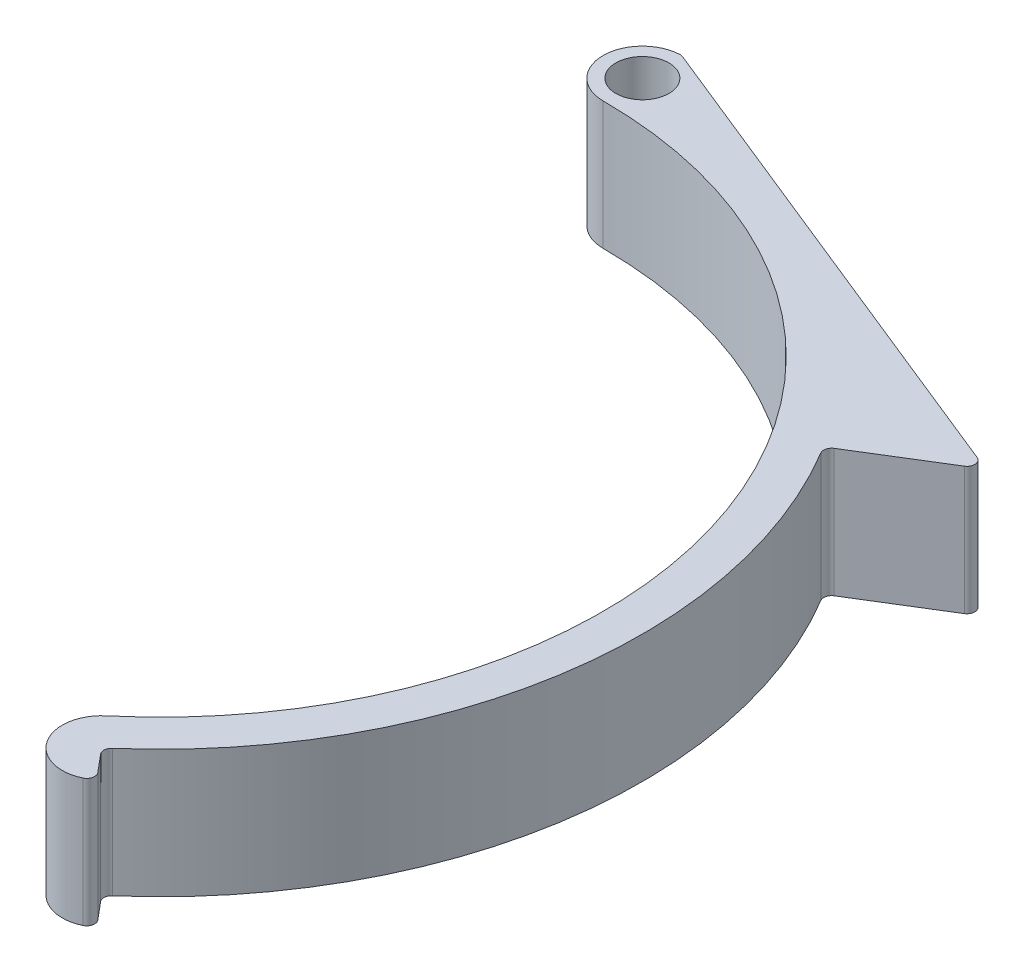
ISO-10303-21;
HEADER;
FILE_DESCRIPTION(('STEP AP214'),'2;1');
FILE_NAME('part.step','',(''),(''),'','','');
FILE_SCHEMA(('AUTOMOTIVE_DESIGN { 1 0 10303 214 1 1 1 1 }'));
ENDSEC;
DATA;
#1=APPLICATION_CONTEXT('core data for automotive mechanical design processes');
#2=APPLICATION_PROTOCOL_DEFINITION('international standard','automotive_design',2000,#1);
#3=PRODUCT_CONTEXT('',#1,'mechanical');
#4=PRODUCT('Part','Part','',(#3));
#5=PRODUCT_RELATED_PRODUCT_CATEGORY('part','',(#4));
#6=PRODUCT_DEFINITION_FORMATION('','',#4);
#7=PRODUCT_DEFINITION_CONTEXT('part definition',#1,'design');
#8=PRODUCT_DEFINITION('design','',#6,#7);
#9=PRODUCT_DEFINITION_SHAPE('','',#8);
#10=(LENGTH_UNIT() NAMED_UNIT(*) SI_UNIT(.MILLI.,.METRE.));
#11=(NAMED_UNIT(*) PLANE_ANGLE_UNIT() SI_UNIT($,.RADIAN.));
#12=(NAMED_UNIT(*) SI_UNIT($,.STERADIAN.) SOLID_ANGLE_UNIT());
#13=UNCERTAINTY_MEASURE_WITH_UNIT(LENGTH_MEASURE(1.E-05),#10,'distance_accuracy_value','');
#14=(GEOMETRIC_REPRESENTATION_CONTEXT(3) GLOBAL_UNCERTAINTY_ASSIGNED_CONTEXT((#13)) GLOBAL_UNIT_ASSIGNED_CONTEXT((#10,
#11,#12)) REPRESENTATION_CONTEXT('',''));
#15=CARTESIAN_POINT('',(0.,0.,0.));
#16=DIRECTION('',(0.,0.,1.));
#17=DIRECTION('',(1.,0.,0.));
#18=AXIS2_PLACEMENT_3D('',#15,#16,#17);
#19=CARTESIAN_POINT('',(18.4107690922549,13.,-45.5602618405853));
#20=DIRECTION('',(0.374663072776281,0.,-0.927161033422908));
#21=DIRECTION('',(-0.927161033422908,0.,-0.374663072776281));
#22=AXIS2_PLACEMENT_3D('',#19,#20,#21);
#23=PLANE('',#22);
#24=DIRECTION('',(0.927161033422908,0.,0.374663072776281));
#25=VECTOR('',#24,1.);
#26=CARTESIAN_POINT('',(18.4107690922549,0.,-45.5602618405853));
#27=LINE('',#26,#25);
#28=CARTESIAN_POINT('',(0.152578115339287,0.,-52.938343628053));
#29=VERTEX_POINT('',#28);
#30=CARTESIAN_POINT('',(50.4547105940548,0.,-32.6113984240491));
#31=VERTEX_POINT('',#30);
#32=EDGE_CURVE('E189',#29,#31,#27,.T.);
#33=ORIENTED_EDGE('',*,*,#32,.F.);
#34=DIRECTION('',(0.,-1.,0.));
#35=VECTOR('',#34,1.);
#36=CARTESIAN_POINT('',(0.152578115339284,13.,-52.938343628053));
#37=LINE('',#36,#35);
#38=CARTESIAN_POINT('',(0.152578115339287,13.,-52.938343628053));
#39=VERTEX_POINT('',#38);
#40=EDGE_CURVE('E231',#29,#39,#37,.F.);
#41=ORIENTED_EDGE('',*,*,#40,.T.);
#42=DIRECTION('',(0.927161033422908,0.,0.374663072776281));
#43=VECTOR('',#42,1.);
#44=CARTESIAN_POINT('',(18.4107690922549,13.,-45.5602618405853));
#45=LINE('',#44,#43);
#46=CARTESIAN_POINT('',(50.4547105940548,13.,-32.6113984240491));
#47=VERTEX_POINT('',#46);
#48=EDGE_CURVE('E165',#39,#47,#45,.T.);
#49=ORIENTED_EDGE('',*,*,#48,.T.);
#50=DIRECTION('',(0.,-1.,0.));
#51=VECTOR('',#50,1.);
#52=CARTESIAN_POINT('',(50.4547105940548,13.,-32.6113984240491));
#53=LINE('',#52,#51);
#54=EDGE_CURVE('E227',#47,#31,#53,.T.);
#55=ORIENTED_EDGE('',*,*,#54,.T.);
#56=EDGE_LOOP('',(#33,#41,#49,#55));
#57=FACE_BOUND('',#56,.T.);
#58=ADVANCED_FACE('F45',(#57),#23,.T.);
#59=CARTESIAN_POINT('',(0.,13.,-49.));
#60=DIRECTION('',(0.,-1.,0.));
#61=DIRECTION('',(0.,0.,-1.));
#62=AXIS2_PLACEMENT_3D('',#59,#60,#61);
#63=CYLINDRICAL_SURFACE('',#62,4.);
#64=CARTESIAN_POINT('',(0.,13.,-49.));
#65=DIRECTION('',(0.,1.,0.));
#66=DIRECTION('',(0.,0.,1.));
#67=AXIS2_PLACEMENT_3D('',#64,#65,#66);
#68=CIRCLE('',#67,4.);
#69=CARTESIAN_POINT('',(0.,13.,-45.));
#70=VERTEX_POINT('',#69);
#71=CARTESIAN_POINT('',(-0.183940428602176,13.,-52.9957685016434));
#72=VERTEX_POINT('',#71);
#73=EDGE_CURVE('E140',#70,#72,#68,.F.);
#74=ORIENTED_EDGE('',*,*,#73,.T.);
#75=DIRECTION('',(0.,-1.,0.));
#76=VECTOR('',#75,1.);
#77=CARTESIAN_POINT('',(-0.183940428602176,13.,-52.9957685016434));
#78=LINE('',#77,#76);
#79=CARTESIAN_POINT('',(-0.183940428602176,0.,-52.9957685016434));
#80=VERTEX_POINT('',#79);
#81=EDGE_CURVE('E148',#72,#80,#78,.T.);
#82=ORIENTED_EDGE('',*,*,#81,.T.);
#83=CARTESIAN_POINT('',(0.,0.,-49.));
#84=DIRECTION('',(0.,1.,0.));
#85=DIRECTION('',(0.,0.,1.));
#86=AXIS2_PLACEMENT_3D('',#83,#84,#85);
#87=CIRCLE('',#86,4.);
#88=CARTESIAN_POINT('',(0.,0.,-45.));
#89=VERTEX_POINT('',#88);
#90=EDGE_CURVE('E143',#89,#80,#87,.F.);
#91=ORIENTED_EDGE('',*,*,#90,.F.);
#92=DIRECTION('',(0.,-1.,0.));
#93=VECTOR('',#92,1.);
#94=CARTESIAN_POINT('',(0.,13.,-45.));
#95=LINE('',#94,#93);
#96=EDGE_CURVE('E135',#70,#89,#95,.T.);
#97=ORIENTED_EDGE('',*,*,#96,.F.);
#98=EDGE_LOOP('',(#74,#82,#91,#97));
#99=FACE_BOUND('',#98,.T.);
#100=ADVANCED_FACE('F137',(#99),#63,.T.);
#101=CARTESIAN_POINT('',(0.,13.,0.));
#102=DIRECTION('',(0.,-1.,0.));
#103=DIRECTION('',(0.,0.,-1.));
#104=AXIS2_PLACEMENT_3D('',#101,#102,#103);
#105=CYLINDRICAL_SURFACE('',#104,45.);
#106=CARTESIAN_POINT('',(0.,0.,0.));
#107=DIRECTION('',(0.,1.,0.));
#108=DIRECTION('',(0.,0.,1.));
#109=AXIS2_PLACEMENT_3D('',#106,#107,#108);
#110=CIRCLE('',#109,45.);
#111=CARTESIAN_POINT('',(28.9254424358944,0.,34.4719999403539));
#112=VERTEX_POINT('',#111);
#113=EDGE_CURVE('E195',#89,#112,#110,.F.);
#114=ORIENTED_EDGE('',*,*,#113,.T.);
#115=DIRECTION('',(0.,-1.,0.));
#116=VECTOR('',#115,1.);
#117=CARTESIAN_POINT('',(28.9254424358944,13.,34.4719999403539));
#118=LINE('',#117,#116);
#119=CARTESIAN_POINT('',(28.9254424358944,13.,34.4719999403539));
#120=VERTEX_POINT('',#119);
#121=EDGE_CURVE('E149',#120,#112,#118,.T.);
#122=ORIENTED_EDGE('',*,*,#121,.F.);
#123=CARTESIAN_POINT('',(0.,13.,0.));
#124=DIRECTION('',(0.,1.,0.));
#125=DIRECTION('',(0.,0.,1.));
#126=AXIS2_PLACEMENT_3D('',#123,#124,#125);
#127=CIRCLE('',#126,45.);
#128=EDGE_CURVE('E153',#70,#120,#127,.F.);
#129=ORIENTED_EDGE('',*,*,#128,.F.);
#130=ORIENTED_EDGE('',*,*,#96,.T.);
#131=EDGE_LOOP('',(#114,#122,#129,#130));
#132=FACE_BOUND('',#131,.T.);
#133=ADVANCED_FACE('F154',(#132),#105,.F.);
#134=CARTESIAN_POINT('',(31.4965928746405,13.,37.5361777128298));
#135=DIRECTION('',(0.,-1.,0.));
#136=DIRECTION('',(0.,0.,-1.));
#137=AXIS2_PLACEMENT_3D('',#134,#135,#136);
#138=CYLINDRICAL_SURFACE('',#137,4.);
#139=CARTESIAN_POINT('',(31.4965928746405,0.,37.5361777128298));
#140=DIRECTION('',(0.,1.,0.));
#141=DIRECTION('',(0.,0.,1.));
#142=AXIS2_PLACEMENT_3D('',#139,#140,#141);
#143=CIRCLE('',#142,4.);
#144=CARTESIAN_POINT('',(33.220054138986,0.,41.1458426931709));
#145=VERTEX_POINT('',#144);
#146=EDGE_CURVE('E198',#112,#145,#143,.T.);
#147=ORIENTED_EDGE('',*,*,#146,.T.);
#148=DIRECTION('',(0.,-1.,0.));
#149=VECTOR('',#148,1.);
#150=CARTESIAN_POINT('',(33.220054138986,13.,41.1458426931709));
#151=LINE('',#150,#149);
#152=CARTESIAN_POINT('',(33.220054138986,13.,41.1458426931709));
#153=VERTEX_POINT('',#152);
#154=EDGE_CURVE('E256',#145,#153,#151,.F.);
#155=ORIENTED_EDGE('',*,*,#154,.T.);
#156=CARTESIAN_POINT('',(31.4965928746405,13.,37.5361777128298));
#157=DIRECTION('',(0.,1.,0.));
#158=DIRECTION('',(0.,0.,1.));
#159=AXIS2_PLACEMENT_3D('',#156,#157,#158);
#160=CIRCLE('',#159,4.);
#161=EDGE_CURVE('E158',#120,#153,#160,.T.);
#162=ORIENTED_EDGE('',*,*,#161,.F.);
#163=ORIENTED_EDGE('',*,*,#121,.T.);
#164=EDGE_LOOP('',(#147,#155,#162,#163));
#165=FACE_BOUND('',#164,.T.);
#166=ADVANCED_FACE('F334',(#165),#138,.T.);
#167=CARTESIAN_POINT('',(0.,13.,0.));
#168=DIRECTION('',(0.766044443118976,0.,-0.642787609686541));
#169=DIRECTION('',(-0.642787609686542,0.,-0.766044443118976));
#170=AXIS2_PLACEMENT_3D('',#167,#168,#169);
#171=PLANE('',#170);
#172=DIRECTION('',(0.642787609686542,0.,0.766044443118976));
#173=VECTOR('',#172,1.);
#174=CARTESIAN_POINT('',(0.,0.,0.));
#175=LINE('',#174,#173);
#176=CARTESIAN_POINT('',(32.0066923337341,0.,38.1440905757849));
#177=VERTEX_POINT('',#176);
#178=CARTESIAN_POINT('',(33.4881974406121,0.,39.9096796093534));
#179=VERTEX_POINT('',#178);
#180=EDGE_CURVE('E202',#177,#179,#175,.T.);
#181=ORIENTED_EDGE('',*,*,#180,.F.);
#182=DIRECTION('',(0.,-1.,0.));
#183=VECTOR('',#182,1.);
#184=CARTESIAN_POINT('',(32.0066923337341,13.,38.1440905757849));
#185=LINE('',#184,#183);
#186=CARTESIAN_POINT('',(32.0066923337341,13.,38.1440905757849));
#187=VERTEX_POINT('',#186);
#188=EDGE_CURVE('E253',#177,#187,#185,.F.);
#189=ORIENTED_EDGE('',*,*,#188,.T.);
#190=DIRECTION('',(0.642787609686542,0.,0.766044443118976));
#191=VECTOR('',#190,1.);
#192=CARTESIAN_POINT('',(0.,13.,0.));
#193=LINE('',#192,#191);
#194=CARTESIAN_POINT('',(33.4881974406121,13.,39.9096796093534));
#195=VERTEX_POINT('',#194);
#196=EDGE_CURVE('E175',#187,#195,#193,.T.);
#197=ORIENTED_EDGE('',*,*,#196,.T.);
#198=DIRECTION('',(0.,1.,0.));
#199=VECTOR('',#198,1.);
#200=CARTESIAN_POINT('',(33.4881974406121,0.,39.9096796093534));
#201=LINE('',#200,#199);
#202=EDGE_CURVE('E249',#195,#179,#201,.F.);
#203=ORIENTED_EDGE('',*,*,#202,.T.);
#204=EDGE_LOOP('',(#181,#189,#197,#203));
#205=FACE_BOUND('',#204,.T.);
#206=ADVANCED_FACE('F319',(#205),#171,.T.);
#207=CARTESIAN_POINT('',(0.,13.,0.));
#208=DIRECTION('',(0.,-1.,0.));
#209=DIRECTION('',(0.,0.,-1.));
#210=AXIS2_PLACEMENT_3D('',#207,#208,#209);
#211=CYLINDRICAL_SURFACE('',#210,49.);
#212=CARTESIAN_POINT('',(0.,13.,0.));
#213=DIRECTION('',(0.,1.,0.));
#214=DIRECTION('',(0.,0.,1.));
#215=AXIS2_PLACEMENT_3D('',#212,#213,#214);
#216=CIRCLE('',#215,49.);
#217=CARTESIAN_POINT('',(32.0955194080971,13.,37.0253647372239));
#218=VERTEX_POINT('',#217);
#219=CARTESIAN_POINT('',(42.1148392112088,13.,-25.0467626294103));
#220=VERTEX_POINT('',#219);
#221=EDGE_CURVE('E179',#218,#220,#216,.T.);
#222=ORIENTED_EDGE('',*,*,#221,.F.);
#223=DIRECTION('',(0.,-1.,0.));
#224=VECTOR('',#223,1.);
#225=CARTESIAN_POINT('',(32.0955194080971,13.,37.0253647372239));
#226=LINE('',#225,#224);
#227=CARTESIAN_POINT('',(32.0955194080971,0.,37.0253647372239));
#228=VERTEX_POINT('',#227);
#229=EDGE_CURVE('E245',#218,#228,#226,.T.);
#230=ORIENTED_EDGE('',*,*,#229,.T.);
#231=CARTESIAN_POINT('',(0.,0.,0.));
#232=DIRECTION('',(0.,1.,0.));
#233=DIRECTION('',(0.,0.,1.));
#234=AXIS2_PLACEMENT_3D('',#231,#232,#233);
#235=CIRCLE('',#234,49.);
#236=CARTESIAN_POINT('',(42.1148392112088,0.,-25.0467626294103));
#237=VERTEX_POINT('',#236);
#238=EDGE_CURVE('E206',#228,#237,#235,.T.);
#239=ORIENTED_EDGE('',*,*,#238,.T.);
#240=DIRECTION('',(0.,-1.,0.));
#241=VECTOR('',#240,1.);
#242=CARTESIAN_POINT('',(42.1148392112088,13.,-25.0467626294103));
#243=LINE('',#242,#241);
#244=EDGE_CURVE('E242',#237,#220,#243,.F.);
#245=ORIENTED_EDGE('',*,*,#244,.T.);
#246=EDGE_LOOP('',(#222,#230,#239,#245));
#247=FACE_BOUND('',#246,.T.);
#248=ADVANCED_FACE('F279',(#247),#211,.T.);
#249=CARTESIAN_POINT('',(0.,13.,-49.));
#250=DIRECTION('',(0.,-1.,0.));
#251=DIRECTION('',(0.,0.,-1.));
#252=AXIS2_PLACEMENT_3D('',#249,#250,#251);
#253=CYLINDRICAL_SURFACE('',#252,2.7);
#254=CARTESIAN_POINT('',(0.,13.,-49.));
#255=DIRECTION('',(0.,1.,0.));
#256=DIRECTION('',(0.,0.,1.));
#257=AXIS2_PLACEMENT_3D('',#254,#255,#256);
#258=CIRCLE('',#257,2.7);
#259=CARTESIAN_POINT('',(0.,13.,-46.3));
#260=VERTEX_POINT('',#259);
#261=EDGE_CURVE('E169',#260,#260,#258,.T.);
#262=ORIENTED_EDGE('',*,*,#261,.T.);
#263=EDGE_LOOP('',(#262));
#264=FACE_BOUND('',#263,.T.);
#265=CARTESIAN_POINT('',(0.,0.,-49.));
#266=DIRECTION('',(0.,1.,0.));
#267=DIRECTION('',(0.,0.,1.));
#268=AXIS2_PLACEMENT_3D('',#265,#266,#267);
#269=CIRCLE('',#268,2.7);
#270=CARTESIAN_POINT('',(0.,0.,-46.3));
#271=VERTEX_POINT('',#270);
#272=EDGE_CURVE('E185',#271,#271,#269,.T.);
#273=ORIENTED_EDGE('',*,*,#272,.F.);
#274=EDGE_LOOP('',(#273));
#275=FACE_BOUND('',#274,.T.);
#276=ADVANCED_FACE('F311',(#264,#275),#253,.F.);
#277=CARTESIAN_POINT('',(0.,13.,0.));
#278=DIRECTION('',(0.524899474172595,0.,0.851164227404637));
#279=DIRECTION('',(0.851164227404637,0.,-0.524899474172595));
#280=AXIS2_PLACEMENT_3D('',#277,#278,#279);
#281=PLANE('',#280);
#282=DIRECTION('',(-0.851164227404637,0.,0.524899474172595));
#283=VECTOR('',#282,1.);
#284=CARTESIAN_POINT('',(0.,0.,0.));
#285=LINE('',#284,#283);
#286=CARTESIAN_POINT('',(50.5748997151719,0.,-31.1887382153871));
#287=VERTEX_POINT('',#286);
#288=CARTESIAN_POINT('',(42.3825088434823,0.,-26.1366207481407));
#289=VERTEX_POINT('',#288);
#290=EDGE_CURVE('E210',#287,#289,#285,.T.);
#291=ORIENTED_EDGE('',*,*,#290,.F.);
#292=DIRECTION('',(0.,-1.,0.));
#293=VECTOR('',#292,1.);
#294=CARTESIAN_POINT('',(50.5748997151719,13.,-31.1887382153871));
#295=LINE('',#294,#293);
#296=CARTESIAN_POINT('',(50.5748997151719,13.,-31.1887382153871));
#297=VERTEX_POINT('',#296);
#298=EDGE_CURVE('E66',#287,#297,#295,.F.);
#299=ORIENTED_EDGE('',*,*,#298,.T.);
#300=DIRECTION('',(-0.851164227404637,0.,0.524899474172595));
#301=VECTOR('',#300,1.);
#302=CARTESIAN_POINT('',(0.,13.,0.));
#303=LINE('',#302,#301);
#304=CARTESIAN_POINT('',(42.3825088434823,13.,-26.1366207481407));
#305=VERTEX_POINT('',#304);
#306=EDGE_CURVE('E182',#297,#305,#303,.T.);
#307=ORIENTED_EDGE('',*,*,#306,.T.);
#308=DIRECTION('',(0.,-1.,0.));
#309=VECTOR('',#308,1.);
#310=CARTESIAN_POINT('',(42.3825088434823,13.,-26.1366207481407));
#311=LINE('',#310,#309);
#312=EDGE_CURVE('E259',#305,#289,#311,.T.);
#313=ORIENTED_EDGE('',*,*,#312,.T.);
#314=EDGE_LOOP('',(#291,#299,#307,#313));
#315=FACE_BOUND('',#314,.T.);
#316=ADVANCED_FACE('F281',(#315),#281,.T.);
#317=CARTESIAN_POINT('',(0.,13.,0.));
#318=DIRECTION('',(0.,1.,0.));
#319=DIRECTION('',(0.,0.,1.));
#320=AXIS2_PLACEMENT_3D('',#317,#318,#319);
#321=PLANE('',#320);
#322=ORIENTED_EDGE('',*,*,#261,.F.);
#323=EDGE_LOOP('',(#322));
#324=FACE_BOUND('',#323,.T.);
#325=ORIENTED_EDGE('',*,*,#48,.F.);
#326=CARTESIAN_POINT('',(-0.147152342881741,13.,-52.1966148013147));
#327=DIRECTION('',(0.,1.,0.));
#328=DIRECTION('',(0.,0.,1.));
#329=AXIS2_PLACEMENT_3D('',#326,#327,#328);
#330=CIRCLE('',#329,0.8);
#331=EDGE_CURVE('E163',#39,#72,#330,.T.);
#332=ORIENTED_EDGE('',*,*,#331,.T.);
#333=ORIENTED_EDGE('',*,*,#73,.F.);
#334=ORIENTED_EDGE('',*,*,#128,.T.);
#335=ORIENTED_EDGE('',*,*,#161,.T.);
#336=CARTESIAN_POINT('',(32.8753618861169,13.,40.4239096971027));
#337=DIRECTION('',(0.,1.,0.));
#338=DIRECTION('',(0.,0.,1.));
#339=AXIS2_PLACEMENT_3D('',#336,#337,#338);
#340=CIRCLE('',#339,0.8);
#341=EDGE_CURVE('E237',#153,#195,#340,.T.);
#342=ORIENTED_EDGE('',*,*,#341,.T.);
#343=ORIENTED_EDGE('',*,*,#196,.F.);
#344=CARTESIAN_POINT('',(32.6195278882293,13.,37.6298604880357));
#345=DIRECTION('',(0.,1.,0.));
#346=DIRECTION('',(0.,0.,1.));
#347=AXIS2_PLACEMENT_3D('',#344,#345,#346);
#348=CIRCLE('',#347,0.8);
#349=EDGE_CURVE('E268',#187,#218,#348,.F.);
#350=ORIENTED_EDGE('',*,*,#349,.T.);
#351=ORIENTED_EDGE('',*,*,#221,.T.);
#352=CARTESIAN_POINT('',(42.8024284228204,13.,-25.455689366217));
#353=DIRECTION('',(0.,1.,0.));
#354=DIRECTION('',(0.,0.,1.));
#355=AXIS2_PLACEMENT_3D('',#352,#353,#354);
#356=CIRCLE('',#355,0.8);
#357=EDGE_CURVE('E11',#220,#305,#356,.F.);
#358=ORIENTED_EDGE('',*,*,#357,.T.);
#359=ORIENTED_EDGE('',*,*,#306,.F.);
#360=CARTESIAN_POINT('',(50.1549801358338,13.,-31.8696695973108));
#361=DIRECTION('',(0.,1.,0.));
#362=DIRECTION('',(0.,0.,1.));
#363=AXIS2_PLACEMENT_3D('',#360,#361,#362);
#364=CIRCLE('',#363,0.8);
#365=EDGE_CURVE('E234',#297,#47,#364,.T.);
#366=ORIENTED_EDGE('',*,*,#365,.T.);
#367=EDGE_LOOP('',(#325,#332,#333,#334,#335,#342,#343,#350,#351,#358,#359,#366));
#368=FACE_BOUND('',#367,.T.);
#369=ADVANCED_FACE('F161',(#324,#368),#321,.T.);
#370=CARTESIAN_POINT('',(0.,0.,0.));
#371=DIRECTION('',(0.,1.,0.));
#372=DIRECTION('',(0.,0.,1.));
#373=AXIS2_PLACEMENT_3D('',#370,#371,#372);
#374=PLANE('',#373);
#375=ORIENTED_EDGE('',*,*,#272,.T.);
#376=EDGE_LOOP('',(#375));
#377=FACE_BOUND('',#376,.T.);
#378=ORIENTED_EDGE('',*,*,#90,.T.);
#379=CARTESIAN_POINT('',(-0.147152342881741,0.,-52.1966148013147));
#380=DIRECTION('',(0.,1.,0.));
#381=DIRECTION('',(0.,0.,1.));
#382=AXIS2_PLACEMENT_3D('',#379,#380,#381);
#383=CIRCLE('',#382,0.8);
#384=EDGE_CURVE('E224',#80,#29,#383,.F.);
#385=ORIENTED_EDGE('',*,*,#384,.T.);
#386=ORIENTED_EDGE('',*,*,#32,.T.);
#387=CARTESIAN_POINT('',(50.1549801358338,0.,-31.8696695973108));
#388=DIRECTION('',(0.,1.,0.));
#389=DIRECTION('',(0.,0.,1.));
#390=AXIS2_PLACEMENT_3D('',#387,#388,#389);
#391=CIRCLE('',#390,0.8);
#392=EDGE_CURVE('E218',#31,#287,#391,.F.);
#393=ORIENTED_EDGE('',*,*,#392,.T.);
#394=ORIENTED_EDGE('',*,*,#290,.T.);
#395=CARTESIAN_POINT('',(42.8024284228204,0.,-25.455689366217));
#396=DIRECTION('',(0.,1.,0.));
#397=DIRECTION('',(0.,0.,1.));
#398=AXIS2_PLACEMENT_3D('',#395,#396,#397);
#399=CIRCLE('',#398,0.8);
#400=EDGE_CURVE('E54',#289,#237,#399,.T.);
#401=ORIENTED_EDGE('',*,*,#400,.T.);
#402=ORIENTED_EDGE('',*,*,#238,.F.);
#403=CARTESIAN_POINT('',(32.6195278882293,0.,37.6298604880357));
#404=DIRECTION('',(0.,1.,0.));
#405=DIRECTION('',(0.,0.,1.));
#406=AXIS2_PLACEMENT_3D('',#403,#404,#405);
#407=CIRCLE('',#406,0.8);
#408=EDGE_CURVE('E265',#228,#177,#407,.T.);
#409=ORIENTED_EDGE('',*,*,#408,.T.);
#410=ORIENTED_EDGE('',*,*,#180,.T.);
#411=CARTESIAN_POINT('',(32.8753618861169,0.,40.4239096971027));
#412=DIRECTION('',(0.,1.,0.));
#413=DIRECTION('',(0.,0.,1.));
#414=AXIS2_PLACEMENT_3D('',#411,#412,#413);
#415=CIRCLE('',#414,0.8);
#416=EDGE_CURVE('E221',#179,#145,#415,.F.);
#417=ORIENTED_EDGE('',*,*,#416,.T.);
#418=ORIENTED_EDGE('',*,*,#146,.F.);
#419=ORIENTED_EDGE('',*,*,#113,.F.);
#420=EDGE_LOOP('',(#378,#385,#386,#393,#394,#401,#402,#409,#410,#417,#418,#419));
#421=FACE_BOUND('',#420,.T.);
#422=ADVANCED_FACE('F273',(#377,#421),#374,.F.);
#423=CARTESIAN_POINT('',(-0.147152342881741,13.,-52.1966148013147));
#424=DIRECTION('',(0.,-1.,0.));
#425=DIRECTION('',(0.,0.,-1.));
#426=AXIS2_PLACEMENT_3D('',#423,#424,#425);
#427=CYLINDRICAL_SURFACE('',#426,0.8);
#428=ORIENTED_EDGE('',*,*,#331,.F.);
#429=ORIENTED_EDGE('',*,*,#40,.F.);
#430=ORIENTED_EDGE('',*,*,#384,.F.);
#431=ORIENTED_EDGE('',*,*,#81,.F.);
#432=EDGE_LOOP('',(#428,#429,#430,#431));
#433=FACE_BOUND('',#432,.T.);
#434=ADVANCED_FACE('F290',(#433),#427,.T.);
#435=CARTESIAN_POINT('',(32.6195278882293,13.,37.6298604880357));
#436=DIRECTION('',(0.,-1.,0.));
#437=DIRECTION('',(0.,0.,-1.));
#438=AXIS2_PLACEMENT_3D('',#435,#436,#437);
#439=CYLINDRICAL_SURFACE('',#438,0.8);
#440=ORIENTED_EDGE('',*,*,#349,.F.);
#441=ORIENTED_EDGE('',*,*,#188,.F.);
#442=ORIENTED_EDGE('',*,*,#408,.F.);
#443=ORIENTED_EDGE('',*,*,#229,.F.);
#444=EDGE_LOOP('',(#440,#441,#442,#443));
#445=FACE_BOUND('',#444,.T.);
#446=ADVANCED_FACE('F292',(#445),#439,.F.);
#447=CARTESIAN_POINT('',(32.8753618861169,13.,40.4239096971027));
#448=DIRECTION('',(0.,-1.,0.));
#449=DIRECTION('',(0.,0.,-1.));
#450=AXIS2_PLACEMENT_3D('',#447,#448,#449);
#451=CYLINDRICAL_SURFACE('',#450,0.8);
#452=ORIENTED_EDGE('',*,*,#341,.F.);
#453=ORIENTED_EDGE('',*,*,#154,.F.);
#454=ORIENTED_EDGE('',*,*,#416,.F.);
#455=ORIENTED_EDGE('',*,*,#202,.F.);
#456=EDGE_LOOP('',(#452,#453,#454,#455));
#457=FACE_BOUND('',#456,.T.);
#458=ADVANCED_FACE('F298',(#457),#451,.T.);
#459=CARTESIAN_POINT('',(50.1549801358338,13.,-31.8696695973108));
#460=DIRECTION('',(0.,-1.,0.));
#461=DIRECTION('',(0.,0.,-1.));
#462=AXIS2_PLACEMENT_3D('',#459,#460,#461);
#463=CYLINDRICAL_SURFACE('',#462,0.8);
#464=ORIENTED_EDGE('',*,*,#365,.F.);
#465=ORIENTED_EDGE('',*,*,#298,.F.);
#466=ORIENTED_EDGE('',*,*,#392,.F.);
#467=ORIENTED_EDGE('',*,*,#54,.F.);
#468=EDGE_LOOP('',(#464,#465,#466,#467));
#469=FACE_BOUND('',#468,.T.);
#470=ADVANCED_FACE('F285',(#469),#463,.T.);
#471=CARTESIAN_POINT('',(42.8024284228204,13.,-25.455689366217));
#472=DIRECTION('',(0.,-1.,0.));
#473=DIRECTION('',(0.,0.,-1.));
#474=AXIS2_PLACEMENT_3D('',#471,#472,#473);
#475=CYLINDRICAL_SURFACE('',#474,0.8);
#476=ORIENTED_EDGE('',*,*,#357,.F.);
#477=ORIENTED_EDGE('',*,*,#244,.F.);
#478=ORIENTED_EDGE('',*,*,#400,.F.);
#479=ORIENTED_EDGE('',*,*,#312,.F.);
#480=EDGE_LOOP('',(#476,#477,#478,#479));
#481=FACE_BOUND('',#480,.T.);
#482=ADVANCED_FACE('F47',(#481),#475,.F.);
#483=CLOSED_SHELL('',(#58,#100,#133,#166,#206,#248,#276,#316,#369,#422,#434,#446,#458,#470,#482));
#484=MANIFOLD_SOLID_BREP('B2',#483);
#485=ADVANCED_BREP_SHAPE_REPRESENTATION('',(#18,#484),#14);
#486=SHAPE_DEFINITION_REPRESENTATION(#9,#485);
ENDSEC;
END-ISO-10303-21;
